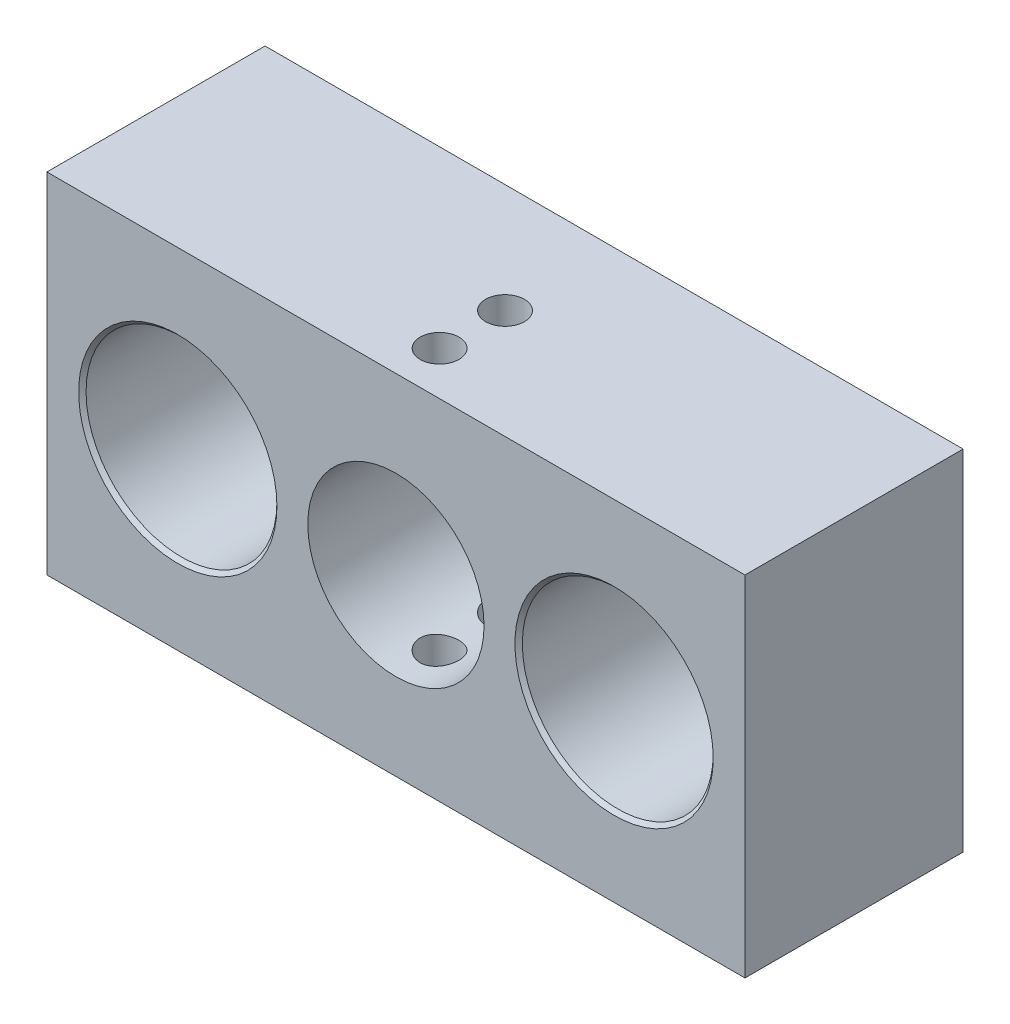
ISO-10303-21;
HEADER;
FILE_DESCRIPTION(('STEP AP214'),'2;1');
FILE_NAME('part.step','',(''),(''),'','','');
FILE_SCHEMA(('AUTOMOTIVE_DESIGN { 1 0 10303 214 1 1 1 1 }'));
ENDSEC;
DATA;
#1=APPLICATION_CONTEXT('core data for automotive mechanical design processes');
#2=APPLICATION_PROTOCOL_DEFINITION('international standard','automotive_design',2000,#1);
#3=PRODUCT_CONTEXT('',#1,'mechanical');
#4=PRODUCT('Part','Part','',(#3));
#5=PRODUCT_RELATED_PRODUCT_CATEGORY('part','',(#4));
#6=PRODUCT_DEFINITION_FORMATION('','',#4);
#7=PRODUCT_DEFINITION_CONTEXT('part definition',#1,'design');
#8=PRODUCT_DEFINITION('design','',#6,#7);
#9=PRODUCT_DEFINITION_SHAPE('','',#8);
#10=(LENGTH_UNIT() NAMED_UNIT(*) SI_UNIT(.MILLI.,.METRE.));
#11=(NAMED_UNIT(*) PLANE_ANGLE_UNIT() SI_UNIT($,.RADIAN.));
#12=(NAMED_UNIT(*) SI_UNIT($,.STERADIAN.) SOLID_ANGLE_UNIT());
#13=UNCERTAINTY_MEASURE_WITH_UNIT(LENGTH_MEASURE(1.E-05),#10,'distance_accuracy_value','');
#14=(GEOMETRIC_REPRESENTATION_CONTEXT(3) GLOBAL_UNCERTAINTY_ASSIGNED_CONTEXT((#13)) GLOBAL_UNIT_ASSIGNED_CONTEXT((#10,
#11,#12)) REPRESENTATION_CONTEXT('',''));
#15=CARTESIAN_POINT('',(0.,0.,0.));
#16=DIRECTION('',(0.,0.,1.));
#17=DIRECTION('',(1.,0.,0.));
#18=AXIS2_PLACEMENT_3D('',#15,#16,#17);
#19=CARTESIAN_POINT('',(0.,0.,12.7));
#20=DIRECTION('',(1.,0.,0.));
#21=DIRECTION('',(0.,1.,0.));
#22=AXIS2_PLACEMENT_3D('',#19,#20,#21);
#23=PLANE('',#22);
#24=DIRECTION('',(0.,-1.,0.));
#25=VECTOR('',#24,1.);
#26=CARTESIAN_POINT('',(0.,0.,0.));
#27=LINE('',#26,#25);
#28=CARTESIAN_POINT('',(0.,20.32,0.));
#29=VERTEX_POINT('',#28);
#30=CARTESIAN_POINT('',(0.,0.,0.));
#31=VERTEX_POINT('',#30);
#32=EDGE_CURVE('E105',#29,#31,#27,.T.);
#33=ORIENTED_EDGE('',*,*,#32,.T.);
#34=DIRECTION('',(0.,0.,-1.));
#35=VECTOR('',#34,1.);
#36=CARTESIAN_POINT('',(0.,0.,12.7));
#37=LINE('',#36,#35);
#38=CARTESIAN_POINT('',(0.,0.,12.7));
#39=VERTEX_POINT('',#38);
#40=EDGE_CURVE('E11',#39,#31,#37,.T.);
#41=ORIENTED_EDGE('',*,*,#40,.F.);
#42=DIRECTION('',(0.,-1.,0.));
#43=VECTOR('',#42,1.);
#44=CARTESIAN_POINT('',(0.,0.,12.7));
#45=LINE('',#44,#43);
#46=CARTESIAN_POINT('',(0.,20.32,12.7));
#47=VERTEX_POINT('',#46);
#48=EDGE_CURVE('E92',#47,#39,#45,.T.);
#49=ORIENTED_EDGE('',*,*,#48,.F.);
#50=DIRECTION('',(0.,0.,-1.));
#51=VECTOR('',#50,1.);
#52=CARTESIAN_POINT('',(0.,20.32,12.7));
#53=LINE('',#52,#51);
#54=EDGE_CURVE('E101',#47,#29,#53,.T.);
#55=ORIENTED_EDGE('',*,*,#54,.T.);
#56=EDGE_LOOP('',(#33,#41,#49,#55));
#57=FACE_BOUND('',#56,.T.);
#58=ADVANCED_FACE('F35',(#57),#23,.F.);
#59=CARTESIAN_POINT('',(0.,0.,12.7));
#60=DIRECTION('',(0.,1.,0.));
#61=DIRECTION('',(0.,0.,1.));
#62=AXIS2_PLACEMENT_3D('',#59,#60,#61);
#63=PLANE('',#62);
#64=CARTESIAN_POINT('',(20.32,0.,10.16));
#65=DIRECTION('',(0.,1.,0.));
#66=DIRECTION('',(0.,0.,1.));
#67=AXIS2_PLACEMENT_3D('',#64,#65,#66);
#68=CIRCLE('',#67,1.13029999999999);
#69=CARTESIAN_POINT('',(20.32,0.,11.2903));
#70=VERTEX_POINT('',#69);
#71=EDGE_CURVE('E143',#70,#70,#68,.T.);
#72=ORIENTED_EDGE('',*,*,#71,.T.);
#73=EDGE_LOOP('',(#72));
#74=FACE_BOUND('',#73,.T.);
#75=CARTESIAN_POINT('',(20.32,0.,6.35));
#76=DIRECTION('',(0.,1.,0.));
#77=DIRECTION('',(0.,0.,1.));
#78=AXIS2_PLACEMENT_3D('',#75,#76,#77);
#79=CIRCLE('',#78,1.13029999999999);
#80=CARTESIAN_POINT('',(20.32,0.,7.4803));
#81=VERTEX_POINT('',#80);
#82=EDGE_CURVE('E121',#81,#81,#79,.T.);
#83=ORIENTED_EDGE('',*,*,#82,.T.);
#84=EDGE_LOOP('',(#83));
#85=FACE_BOUND('',#84,.T.);
#86=DIRECTION('',(1.,0.,0.));
#87=VECTOR('',#86,1.);
#88=CARTESIAN_POINT('',(0.,0.,0.));
#89=LINE('',#88,#87);
#90=CARTESIAN_POINT('',(40.64,0.,0.));
#91=VERTEX_POINT('',#90);
#92=EDGE_CURVE('E96',#31,#91,#89,.T.);
#93=ORIENTED_EDGE('',*,*,#92,.T.);
#94=DIRECTION('',(0.,0.,-1.));
#95=VECTOR('',#94,1.);
#96=CARTESIAN_POINT('',(40.64,0.,12.7));
#97=LINE('',#96,#95);
#98=CARTESIAN_POINT('',(40.64,0.,12.7));
#99=VERTEX_POINT('',#98);
#100=EDGE_CURVE('E48',#99,#91,#97,.T.);
#101=ORIENTED_EDGE('',*,*,#100,.F.);
#102=DIRECTION('',(1.,0.,0.));
#103=VECTOR('',#102,1.);
#104=CARTESIAN_POINT('',(0.,0.,12.7));
#105=LINE('',#104,#103);
#106=EDGE_CURVE('E87',#39,#99,#105,.T.);
#107=ORIENTED_EDGE('',*,*,#106,.F.);
#108=ORIENTED_EDGE('',*,*,#40,.T.);
#109=EDGE_LOOP('',(#93,#101,#107,#108));
#110=FACE_BOUND('',#109,.T.);
#111=ADVANCED_FACE('F95',(#74,#85,#110),#63,.F.);
#112=CARTESIAN_POINT('',(40.64,0.,12.7));
#113=DIRECTION('',(-1.,0.,0.));
#114=DIRECTION('',(0.,0.,1.));
#115=AXIS2_PLACEMENT_3D('',#112,#113,#114);
#116=PLANE('',#115);
#117=DIRECTION('',(0.,1.,0.));
#118=VECTOR('',#117,1.);
#119=CARTESIAN_POINT('',(40.64,0.,0.));
#120=LINE('',#119,#118);
#121=CARTESIAN_POINT('',(40.64,20.32,0.));
#122=VERTEX_POINT('',#121);
#123=EDGE_CURVE('E74',#91,#122,#120,.T.);
#124=ORIENTED_EDGE('',*,*,#123,.T.);
#125=DIRECTION('',(0.,0.,-1.));
#126=VECTOR('',#125,1.);
#127=CARTESIAN_POINT('',(40.64,20.32,12.7));
#128=LINE('',#127,#126);
#129=CARTESIAN_POINT('',(40.64,20.32,12.7));
#130=VERTEX_POINT('',#129);
#131=EDGE_CURVE('E97',#130,#122,#128,.T.);
#132=ORIENTED_EDGE('',*,*,#131,.F.);
#133=DIRECTION('',(0.,1.,0.));
#134=VECTOR('',#133,1.);
#135=CARTESIAN_POINT('',(40.64,0.,12.7));
#136=LINE('',#135,#134);
#137=EDGE_CURVE('E90',#99,#130,#136,.T.);
#138=ORIENTED_EDGE('',*,*,#137,.F.);
#139=ORIENTED_EDGE('',*,*,#100,.T.);
#140=EDGE_LOOP('',(#124,#132,#138,#139));
#141=FACE_BOUND('',#140,.T.);
#142=ADVANCED_FACE('F99',(#141),#116,.F.);
#143=CARTESIAN_POINT('',(0.,20.32,12.7));
#144=DIRECTION('',(0.,-1.,0.));
#145=DIRECTION('',(0.,0.,-1.));
#146=AXIS2_PLACEMENT_3D('',#143,#144,#145);
#147=PLANE('',#146);
#148=CARTESIAN_POINT('',(20.32,20.32,10.16));
#149=DIRECTION('',(0.,1.,0.));
#150=DIRECTION('',(0.,0.,1.));
#151=AXIS2_PLACEMENT_3D('',#148,#149,#150);
#152=CIRCLE('',#151,1.1303);
#153=CARTESIAN_POINT('',(20.32,20.32,11.2903));
#154=VERTEX_POINT('',#153);
#155=EDGE_CURVE('E149',#154,#154,#152,.T.);
#156=ORIENTED_EDGE('',*,*,#155,.F.);
#157=EDGE_LOOP('',(#156));
#158=FACE_BOUND('',#157,.T.);
#159=CARTESIAN_POINT('',(20.32,20.32,6.35));
#160=DIRECTION('',(0.,1.,0.));
#161=DIRECTION('',(0.,0.,1.));
#162=AXIS2_PLACEMENT_3D('',#159,#160,#161);
#163=CIRCLE('',#162,1.1303);
#164=CARTESIAN_POINT('',(20.32,20.32,7.4803));
#165=VERTEX_POINT('',#164);
#166=EDGE_CURVE('E147',#165,#165,#163,.T.);
#167=ORIENTED_EDGE('',*,*,#166,.F.);
#168=EDGE_LOOP('',(#167));
#169=FACE_BOUND('',#168,.T.);
#170=DIRECTION('',(-1.,0.,0.));
#171=VECTOR('',#170,1.);
#172=CARTESIAN_POINT('',(0.,20.32,0.));
#173=LINE('',#172,#171);
#174=EDGE_CURVE('E80',#122,#29,#173,.T.);
#175=ORIENTED_EDGE('',*,*,#174,.T.);
#176=ORIENTED_EDGE('',*,*,#54,.F.);
#177=DIRECTION('',(-1.,0.,0.));
#178=VECTOR('',#177,1.);
#179=CARTESIAN_POINT('',(0.,20.32,12.7));
#180=LINE('',#179,#178);
#181=EDGE_CURVE('E57',#130,#47,#180,.T.);
#182=ORIENTED_EDGE('',*,*,#181,.F.);
#183=ORIENTED_EDGE('',*,*,#131,.T.);
#184=EDGE_LOOP('',(#175,#176,#182,#183));
#185=FACE_BOUND('',#184,.T.);
#186=ADVANCED_FACE('F225',(#158,#169,#185),#147,.F.);
#187=CARTESIAN_POINT('',(0.,0.,12.7));
#188=DIRECTION('',(0.,0.,-1.));
#189=DIRECTION('',(-1.,0.,0.));
#190=AXIS2_PLACEMENT_3D('',#187,#188,#189);
#191=PLANE('',#190);
#192=CARTESIAN_POINT('',(20.32,10.16,12.7));
#193=DIRECTION('',(0.,0.,1.));
#194=DIRECTION('',(1.,0.,0.));
#195=AXIS2_PLACEMENT_3D('',#192,#193,#194);
#196=CIRCLE('',#195,5.13080000000001);
#197=CARTESIAN_POINT('',(25.4508,10.16,12.7));
#198=VERTEX_POINT('',#197);
#199=EDGE_CURVE('E160',#198,#198,#196,.T.);
#200=ORIENTED_EDGE('',*,*,#199,.F.);
#201=EDGE_LOOP('',(#200));
#202=FACE_BOUND('',#201,.T.);
#203=CARTESIAN_POINT('',(7.62,10.16,12.7));
#204=DIRECTION('',(0.,0.,1.));
#205=DIRECTION('',(1.,0.,0.));
#206=AXIS2_PLACEMENT_3D('',#203,#204,#205);
#207=CIRCLE('',#206,5.77215);
#208=CARTESIAN_POINT('',(13.39215,10.16,12.7));
#209=VERTEX_POINT('',#208);
#210=EDGE_CURVE('E166',#209,#209,#207,.T.);
#211=ORIENTED_EDGE('',*,*,#210,.F.);
#212=EDGE_LOOP('',(#211));
#213=FACE_BOUND('',#212,.T.);
#214=CARTESIAN_POINT('',(33.02,10.16,12.7));
#215=DIRECTION('',(0.,0.,1.));
#216=DIRECTION('',(1.,0.,0.));
#217=AXIS2_PLACEMENT_3D('',#214,#215,#216);
#218=CIRCLE('',#217,5.77215);
#219=CARTESIAN_POINT('',(38.79215,10.16,12.7));
#220=VERTEX_POINT('',#219);
#221=EDGE_CURVE('E181',#220,#220,#218,.T.);
#222=ORIENTED_EDGE('',*,*,#221,.F.);
#223=EDGE_LOOP('',(#222));
#224=FACE_BOUND('',#223,.T.);
#225=ORIENTED_EDGE('',*,*,#48,.T.);
#226=ORIENTED_EDGE('',*,*,#106,.T.);
#227=ORIENTED_EDGE('',*,*,#137,.T.);
#228=ORIENTED_EDGE('',*,*,#181,.T.);
#229=EDGE_LOOP('',(#225,#226,#227,#228));
#230=FACE_BOUND('',#229,.T.);
#231=ADVANCED_FACE('F88',(#202,#213,#224,#230),#191,.F.);
#232=CARTESIAN_POINT('',(0.,0.,0.));
#233=DIRECTION('',(0.,0.,-1.));
#234=DIRECTION('',(-1.,0.,0.));
#235=AXIS2_PLACEMENT_3D('',#232,#233,#234);
#236=PLANE('',#235);
#237=CARTESIAN_POINT('',(7.62,10.16,0.));
#238=DIRECTION('',(0.,0.,1.));
#239=DIRECTION('',(1.,0.,0.));
#240=AXIS2_PLACEMENT_3D('',#237,#238,#239);
#241=CIRCLE('',#240,3.3782);
#242=CARTESIAN_POINT('',(10.9982,10.16,0.));
#243=VERTEX_POINT('',#242);
#244=EDGE_CURVE('E178',#243,#243,#241,.T.);
#245=ORIENTED_EDGE('',*,*,#244,.T.);
#246=EDGE_LOOP('',(#245));
#247=FACE_BOUND('',#246,.T.);
#248=CARTESIAN_POINT('',(33.02,10.16,0.));
#249=DIRECTION('',(0.,0.,1.));
#250=DIRECTION('',(1.,0.,0.));
#251=AXIS2_PLACEMENT_3D('',#248,#249,#250);
#252=CIRCLE('',#251,3.3782);
#253=CARTESIAN_POINT('',(36.3982,10.16,0.));
#254=VERTEX_POINT('',#253);
#255=EDGE_CURVE('E108',#254,#254,#252,.T.);
#256=ORIENTED_EDGE('',*,*,#255,.T.);
#257=EDGE_LOOP('',(#256));
#258=FACE_BOUND('',#257,.T.);
#259=ORIENTED_EDGE('',*,*,#32,.F.);
#260=ORIENTED_EDGE('',*,*,#174,.F.);
#261=ORIENTED_EDGE('',*,*,#123,.F.);
#262=ORIENTED_EDGE('',*,*,#92,.F.);
#263=EDGE_LOOP('',(#259,#260,#261,#262));
#264=FACE_BOUND('',#263,.T.);
#265=ADVANCED_FACE('F196',(#247,#258,#264),#236,.T.);
#266=CARTESIAN_POINT('',(33.02,10.16,12.7));
#267=DIRECTION('',(0.,0.,1.));
#268=DIRECTION('',(1.,0.,0.));
#269=AXIS2_PLACEMENT_3D('',#266,#267,#268);
#270=CYLINDRICAL_SURFACE('',#269,3.3782);
#271=ORIENTED_EDGE('',*,*,#255,.F.);
#272=EDGE_LOOP('',(#271));
#273=FACE_BOUND('',#272,.T.);
#274=CARTESIAN_POINT('',(33.02,10.16,3.175));
#275=DIRECTION('',(0.,0.,1.));
#276=DIRECTION('',(1.,0.,0.));
#277=AXIS2_PLACEMENT_3D('',#274,#275,#276);
#278=CIRCLE('',#277,3.3782);
#279=CARTESIAN_POINT('',(36.3982,10.16,3.175));
#280=VERTEX_POINT('',#279);
#281=EDGE_CURVE('E190',#280,#280,#278,.T.);
#282=ORIENTED_EDGE('',*,*,#281,.T.);
#283=EDGE_LOOP('',(#282));
#284=FACE_BOUND('',#283,.T.);
#285=ADVANCED_FACE('F199',(#273,#284),#270,.F.);
#286=CARTESIAN_POINT('',(38.57625,10.16,3.175));
#287=DIRECTION('',(0.,0.,-1.));
#288=DIRECTION('',(-1.,0.,0.));
#289=AXIS2_PLACEMENT_3D('',#286,#287,#288);
#290=PLANE('',#289);
#291=ORIENTED_EDGE('',*,*,#281,.F.);
#292=EDGE_LOOP('',(#291));
#293=FACE_BOUND('',#292,.T.);
#294=CARTESIAN_POINT('',(33.02,10.16,3.175));
#295=DIRECTION('',(0.,0.,1.));
#296=DIRECTION('',(1.,0.,0.));
#297=AXIS2_PLACEMENT_3D('',#294,#295,#296);
#298=CIRCLE('',#297,5.55625);
#299=CARTESIAN_POINT('',(38.57625,10.16,3.175));
#300=VERTEX_POINT('',#299);
#301=EDGE_CURVE('E187',#300,#300,#298,.T.);
#302=ORIENTED_EDGE('',*,*,#301,.T.);
#303=EDGE_LOOP('',(#302));
#304=FACE_BOUND('',#303,.T.);
#305=ADVANCED_FACE('F202',(#293,#304),#290,.F.);
#306=CARTESIAN_POINT('',(33.02,10.16,12.7));
#307=DIRECTION('',(0.,0.,1.));
#308=DIRECTION('',(1.,0.,0.));
#309=AXIS2_PLACEMENT_3D('',#306,#307,#308);
#310=CYLINDRICAL_SURFACE('',#309,5.55625);
#311=ORIENTED_EDGE('',*,*,#301,.F.);
#312=EDGE_LOOP('',(#311));
#313=FACE_BOUND('',#312,.T.);
#314=CARTESIAN_POINT('',(33.02,10.16,12.4841));
#315=DIRECTION('',(0.,0.,1.));
#316=DIRECTION('',(1.,0.,0.));
#317=AXIS2_PLACEMENT_3D('',#314,#315,#316);
#318=CIRCLE('',#317,5.55625);
#319=CARTESIAN_POINT('',(38.57625,10.16,12.4841));
#320=VERTEX_POINT('',#319);
#321=EDGE_CURVE('E184',#320,#320,#318,.T.);
#322=ORIENTED_EDGE('',*,*,#321,.T.);
#323=EDGE_LOOP('',(#322));
#324=FACE_BOUND('',#323,.T.);
#325=ADVANCED_FACE('F208',(#313,#324),#310,.F.);
#326=CARTESIAN_POINT('',(33.02,10.16,12.7));
#327=DIRECTION('',(0.,0.,1.));
#328=DIRECTION('',(1.,0.,0.));
#329=AXIS2_PLACEMENT_3D('',#326,#327,#328);
#330=CONICAL_SURFACE('',#329,5.77215,0.78539816339744);
#331=ORIENTED_EDGE('',*,*,#321,.F.);
#332=EDGE_LOOP('',(#331));
#333=FACE_BOUND('',#332,.T.);
#334=ORIENTED_EDGE('',*,*,#221,.T.);
#335=EDGE_LOOP('',(#334));
#336=FACE_BOUND('',#335,.T.);
#337=ADVANCED_FACE('F214',(#333,#336),#330,.F.);
#338=CARTESIAN_POINT('',(7.62,10.16,12.7));
#339=DIRECTION('',(0.,0.,1.));
#340=DIRECTION('',(1.,0.,0.));
#341=AXIS2_PLACEMENT_3D('',#338,#339,#340);
#342=CYLINDRICAL_SURFACE('',#341,3.3782);
#343=ORIENTED_EDGE('',*,*,#244,.F.);
#344=EDGE_LOOP('',(#343));
#345=FACE_BOUND('',#344,.T.);
#346=CARTESIAN_POINT('',(7.62,10.16,3.175));
#347=DIRECTION('',(0.,0.,1.));
#348=DIRECTION('',(1.,0.,0.));
#349=AXIS2_PLACEMENT_3D('',#346,#347,#348);
#350=CIRCLE('',#349,3.3782);
#351=CARTESIAN_POINT('',(10.9982,10.16,3.175));
#352=VERTEX_POINT('',#351);
#353=EDGE_CURVE('E175',#352,#352,#350,.T.);
#354=ORIENTED_EDGE('',*,*,#353,.T.);
#355=EDGE_LOOP('',(#354));
#356=FACE_BOUND('',#355,.T.);
#357=ADVANCED_FACE('F220',(#345,#356),#342,.F.);
#358=CARTESIAN_POINT('',(13.17625,10.16,3.175));
#359=DIRECTION('',(0.,0.,-1.));
#360=DIRECTION('',(-1.,0.,0.));
#361=AXIS2_PLACEMENT_3D('',#358,#359,#360);
#362=PLANE('',#361);
#363=ORIENTED_EDGE('',*,*,#353,.F.);
#364=EDGE_LOOP('',(#363));
#365=FACE_BOUND('',#364,.T.);
#366=CARTESIAN_POINT('',(7.62,10.16,3.175));
#367=DIRECTION('',(0.,0.,1.));
#368=DIRECTION('',(1.,0.,0.));
#369=AXIS2_PLACEMENT_3D('',#366,#367,#368);
#370=CIRCLE('',#369,5.55625);
#371=CARTESIAN_POINT('',(13.17625,10.16,3.175));
#372=VERTEX_POINT('',#371);
#373=EDGE_CURVE('E172',#372,#372,#370,.T.);
#374=ORIENTED_EDGE('',*,*,#373,.T.);
#375=EDGE_LOOP('',(#374));
#376=FACE_BOUND('',#375,.T.);
#377=ADVANCED_FACE('F274',(#365,#376),#362,.F.);
#378=CARTESIAN_POINT('',(7.62,10.16,12.7));
#379=DIRECTION('',(0.,0.,1.));
#380=DIRECTION('',(1.,0.,0.));
#381=AXIS2_PLACEMENT_3D('',#378,#379,#380);
#382=CYLINDRICAL_SURFACE('',#381,5.55625);
#383=ORIENTED_EDGE('',*,*,#373,.F.);
#384=EDGE_LOOP('',(#383));
#385=FACE_BOUND('',#384,.T.);
#386=CARTESIAN_POINT('',(7.62,10.16,12.4841));
#387=DIRECTION('',(0.,0.,1.));
#388=DIRECTION('',(1.,0.,0.));
#389=AXIS2_PLACEMENT_3D('',#386,#387,#388);
#390=CIRCLE('',#389,5.55625);
#391=CARTESIAN_POINT('',(13.17625,10.16,12.4841));
#392=VERTEX_POINT('',#391);
#393=EDGE_CURVE('E169',#392,#392,#390,.T.);
#394=ORIENTED_EDGE('',*,*,#393,.T.);
#395=EDGE_LOOP('',(#394));
#396=FACE_BOUND('',#395,.T.);
#397=ADVANCED_FACE('F268',(#385,#396),#382,.F.);
#398=CARTESIAN_POINT('',(7.62,10.16,12.7));
#399=DIRECTION('',(0.,0.,1.));
#400=DIRECTION('',(1.,0.,0.));
#401=AXIS2_PLACEMENT_3D('',#398,#399,#400);
#402=CONICAL_SURFACE('',#401,5.77215,0.785398163397448);
#403=ORIENTED_EDGE('',*,*,#393,.F.);
#404=EDGE_LOOP('',(#403));
#405=FACE_BOUND('',#404,.T.);
#406=ORIENTED_EDGE('',*,*,#210,.T.);
#407=EDGE_LOOP('',(#406));
#408=FACE_BOUND('',#407,.T.);
#409=ADVANCED_FACE('F264',(#405,#408),#402,.F.);
#410=CARTESIAN_POINT('',(20.32,10.16,3.175));
#411=DIRECTION('',(0.,0.,-1.));
#412=DIRECTION('',(-1.,0.,0.));
#413=AXIS2_PLACEMENT_3D('',#410,#411,#412);
#414=PLANE('',#413);
#415=CARTESIAN_POINT('',(20.32,10.16,3.175));
#416=DIRECTION('',(0.,0.,1.));
#417=DIRECTION('',(1.,0.,0.));
#418=AXIS2_PLACEMENT_3D('',#415,#416,#417);
#419=CIRCLE('',#418,5.13080000000001);
#420=CARTESIAN_POINT('',(25.4508,10.16,3.175));
#421=VERTEX_POINT('',#420);
#422=EDGE_CURVE('E163',#421,#421,#419,.T.);
#423=ORIENTED_EDGE('',*,*,#422,.T.);
#424=EDGE_LOOP('',(#423));
#425=FACE_BOUND('',#424,.T.);
#426=ADVANCED_FACE('F256',(#425),#414,.F.);
#427=CARTESIAN_POINT('',(20.32,10.16,12.7));
#428=DIRECTION('',(0.,0.,1.));
#429=DIRECTION('',(1.,0.,0.));
#430=AXIS2_PLACEMENT_3D('',#427,#428,#429);
#431=CYLINDRICAL_SURFACE('',#430,5.13080000000001);
#432=CARTESIAN_POINT('',(20.32,5.02919999999999,11.2903));
#433=CARTESIAN_POINT('',(20.2573219160591,5.0292011544134,11.2902978752993));
#434=CARTESIAN_POINT('',(20.1946182554503,5.0303601776866,11.2850689064002));
#435=CARTESIAN_POINT('',(20.0709927719037,5.03487178645669,11.2643133541529));
#436=CARTESIAN_POINT('',(20.0100722416246,5.03822592404732,11.2487794844392));
#437=CARTESIAN_POINT('',(19.8918174658165,5.0467544005245,11.2079248847462));
#438=CARTESIAN_POINT('',(19.8344795207196,5.05192682390269,11.1826144513156));
#439=CARTESIAN_POINT('',(19.724865942065,5.0635339738036,11.1229580432425));
#440=CARTESIAN_POINT('',(19.672590192185,5.06996867131072,11.0886122762869));
#441=CARTESIAN_POINT('',(19.573732802766,5.0835127708652,11.0112690634877));
#442=CARTESIAN_POINT('',(19.5272452773042,5.09063064098196,10.9681527970232));
#443=CARTESIAN_POINT('',(19.4421000930962,5.10467935531677,10.8747475505647));
#444=CARTESIAN_POINT('',(19.4034431405306,5.11161018261802,10.8244579243555));
#445=CARTESIAN_POINT('',(19.3346399047327,5.12458365566658,10.717435991638));
#446=CARTESIAN_POINT('',(19.3045940530291,5.13061545511933,10.6606376864405));
#447=CARTESIAN_POINT('',(19.2545102053322,5.14098629054407,10.5426432840008));
#448=CARTESIAN_POINT('',(19.234470994169,5.14532553204013,10.4814477217784));
#449=CARTESIAN_POINT('',(19.205280780433,5.15173366736412,10.3574175165217));
#450=CARTESIAN_POINT('',(19.1959630214741,5.15383729228967,10.2946239521598));
#451=CARTESIAN_POINT('',(19.1879616569993,5.15564030777462,10.1683323483302));
#452=CARTESIAN_POINT('',(19.1892767248565,5.15533999826596,10.1048343977338));
#453=CARTESIAN_POINT('',(19.2023695425516,5.15240050869015,9.98017797875042));
#454=CARTESIAN_POINT('',(19.2139533432465,5.14980468697107,9.91899796206095));
#455=CARTESIAN_POINT('',(19.2469474308058,5.14263523439493,9.79947155363101));
#456=CARTESIAN_POINT('',(19.2683582760958,5.13806149114257,9.74112532312992));
#457=CARTESIAN_POINT('',(19.3205761520776,5.12740895417049,9.62837868180645));
#458=CARTESIAN_POINT('',(19.3514575594936,5.12131832143159,9.57401388324181));
#459=CARTESIAN_POINT('',(19.4216876665217,5.10832549984097,9.47116628118922));
#460=CARTESIAN_POINT('',(19.4610375360674,5.10142319891561,9.42268429187093));
#461=CARTESIAN_POINT('',(19.5481131954782,5.08739888601198,9.33186214398028));
#462=CARTESIAN_POINT('',(19.5960038496458,5.08027537656772,9.2896801221565));
#463=CARTESIAN_POINT('',(19.6982603308901,5.06674916563056,9.21392028958861));
#464=CARTESIAN_POINT('',(19.752626278534,5.0603464775634,9.18034263909117));
#465=CARTESIAN_POINT('',(19.8664846528425,5.04896206362739,9.12270473741646));
#466=CARTESIAN_POINT('',(19.9259880209604,5.04398347302569,9.09866544137605));
#467=CARTESIAN_POINT('',(20.0483237597559,5.03603148026805,9.06097080334443));
#468=CARTESIAN_POINT('',(20.1111556377425,5.03305778223444,9.04731392910008));
#469=CARTESIAN_POINT('',(20.2370085903685,5.0294928234158,9.03100235281824));
#470=CARTESIAN_POINT('',(20.3000003844654,5.02885479961266,9.02813166694003));
#471=CARTESIAN_POINT('',(20.4255634798779,5.0299019333558,9.03288821247717));
#472=CARTESIAN_POINT('',(20.4881348098484,5.0315869309391,9.0405147210569));
#473=CARTESIAN_POINT('',(20.610363534366,5.0370612447256,9.0658701144836));
#474=CARTESIAN_POINT('',(20.6700456269484,5.04082690707367,9.08348549975974));
#475=CARTESIAN_POINT('',(20.785607808864,5.05004096777386,9.12819245823515));
#476=CARTESIAN_POINT('',(20.8414875705983,5.05548951089506,9.15528484671613));
#477=CARTESIAN_POINT('',(20.9487503776862,5.06758017082409,9.21862527231828));
#478=CARTESIAN_POINT('',(21.0000568053095,5.07423839241349,9.25499991371493));
#479=CARTESIAN_POINT('',(21.0959149362329,5.08797735855574,9.3357058232722));
#480=CARTESIAN_POINT('',(21.1404657473014,5.09505815874782,9.38003814073808));
#481=CARTESIAN_POINT('',(21.22240366135,5.10900608114204,9.47639269205905));
#482=CARTESIAN_POINT('',(21.2596411033624,5.11586672494157,9.52854330718928));
#483=CARTESIAN_POINT('',(21.3248301081039,5.12844638678479,9.63848485107425));
#484=CARTESIAN_POINT('',(21.3527820744665,5.13416545444774,9.69627553451756));
#485=CARTESIAN_POINT('',(21.3984166024768,5.14375932766124,9.81554586598282));
#486=CARTESIAN_POINT('',(21.4161571992222,5.14764453257467,9.87700243105533));
#487=CARTESIAN_POINT('',(21.4410347791615,5.15314919624246,10.0021210653018));
#488=CARTESIAN_POINT('',(21.4481734861427,5.15476902332764,10.0657827742131));
#489=CARTESIAN_POINT('',(21.4515704626756,5.15553608207552,10.1919949713662));
#490=CARTESIAN_POINT('',(21.4480661071725,5.15473725874692,10.2545388593839));
#491=CARTESIAN_POINT('',(21.4308077006114,5.15087915343435,10.3781213920473));
#492=CARTESIAN_POINT('',(21.4170537739577,5.14781989888639,10.4391600549535));
#493=CARTESIAN_POINT('',(21.3798020756864,5.13981211378289,10.5578076305887));
#494=CARTESIAN_POINT('',(21.3563393239267,5.13487037839671,10.6154280275515));
#495=CARTESIAN_POINT('',(21.3003659057,5.12365186829724,10.7259496582337));
#496=CARTESIAN_POINT('',(21.2678542809857,5.11737495220909,10.7788503913716));
#497=CARTESIAN_POINT('',(21.1939207242673,5.10403253145682,10.8796001282511));
#498=CARTESIAN_POINT('',(21.1523298288636,5.09695350104701,10.9273233732524));
#499=CARTESIAN_POINT('',(21.0617601467123,5.08289485773588,11.0151910670497));
#500=CARTESIAN_POINT('',(21.0127796529774,5.07591526821402,11.0553337599115));
#501=CARTESIAN_POINT('',(20.9080418338021,5.06273259771217,11.1274086756848));
#502=CARTESIAN_POINT('',(20.8522035811565,5.05654098406301,11.1592255134409));
#503=CARTESIAN_POINT('',(20.7358467255188,5.04574717820908,11.2129715982874));
#504=CARTESIAN_POINT('',(20.6753320707406,5.04114366276088,11.2349090817831));
#505=CARTESIAN_POINT('',(20.5656369145147,5.03485957709541,11.2643944138461));
#506=CARTESIAN_POINT('',(20.5170468581741,5.03275044740425,11.2740903611331));
#507=CARTESIAN_POINT('',(20.4189764907477,5.02992023464161,11.2870438465654));
#508=CARTESIAN_POINT('',(20.3694962202991,5.02919908837192,11.2903016778537));
#509=CARTESIAN_POINT('',(20.32,5.02919999999999,11.2903));
#510=B_SPLINE_CURVE_WITH_KNOTS('',3,(#432,#433,#434,#435,#436,#437,#438,#439,#440,#441,#442,
#443,#444,#445,#446,#447,#448,#449,#450,#451,#452,#453,#454,#455,#456,#457,#458,#459,#460,#461,
#462,#463,#464,#465,#466,#467,#468,#469,#470,#471,#472,#473,#474,#475,#476,#477,#478,#479,#480,
#481,#482,#483,#484,#485,#486,#487,#488,#489,#490,#491,#492,#493,#494,#495,#496,#497,#498,#499,
#500,#501,#502,#503,#504,#505,#506,#507,#508,#509),.UNSPECIFIED.,.T.,.F.,(4,2,2,2,2,2,2,2,2,2,2,
2,2,2,2,2,2,2,2,2,2,2,2,2,2,2,2,2,2,2,2,2,2,2,2,2,2,2,4),(0.,0.187853066104585,
0.375839100698793,0.563627688324262,0.751411959804079,0.941933640984928,1.1324724962416,
1.32515072845262,1.51780555682658,1.70742159968374,1.89701398506383,2.08310000355243,
2.26919659775926,2.45679383771819,2.64441701123887,2.83615771528223,3.0279019900194,
3.22006521234824,3.41220006943687,3.60046644101022,3.7887198492311,3.97487588261003,
4.16104793444407,4.34990932995401,4.53879564719082,4.73121671935614,4.92362942600723,
5.11493749679242,5.30621445892374,5.49325688753215,5.68029704594765,5.8666683490204,
6.05305939574366,6.24327060071083,6.43352581167807,6.62629264774834,6.81889847547651,
6.96725081092421,7.11559639137525),.UNSPECIFIED.);
#511=CARTESIAN_POINT('',(20.32,5.02919999999999,11.2903));
#512=VERTEX_POINT('',#511);
#513=EDGE_CURVE('E38',#512,#512,#510,.T.);
#514=ORIENTED_EDGE('',*,*,#513,.T.);
#515=EDGE_LOOP('',(#514));
#516=FACE_BOUND('',#515,.T.);
#517=CARTESIAN_POINT('',(20.32,15.2908,11.2903));
#518=CARTESIAN_POINT('',(20.3826780839409,15.2907988455866,11.2902978752993));
#519=CARTESIAN_POINT('',(20.4453817445497,15.2896398223134,11.2850689064002));
#520=CARTESIAN_POINT('',(20.5690072280963,15.2851282135433,11.2643133541529));
#521=CARTESIAN_POINT('',(20.6299277583754,15.2817740759527,11.2487794844392));
#522=CARTESIAN_POINT('',(20.7481825341835,15.2732455994755,11.2079248847462));
#523=CARTESIAN_POINT('',(20.8055204792804,15.2680731760973,11.1826144513156));
#524=CARTESIAN_POINT('',(20.915134057935,15.2564660261964,11.1229580432425));
#525=CARTESIAN_POINT('',(20.967409807815,15.2500313286893,11.0886122762869));
#526=CARTESIAN_POINT('',(21.066267197234,15.2364872291348,11.0112690634877));
#527=CARTESIAN_POINT('',(21.1127547226959,15.229369359018,10.9681527970232));
#528=CARTESIAN_POINT('',(21.1978999069038,15.2153206446832,10.8747475505647));
#529=CARTESIAN_POINT('',(21.2365568594695,15.208389817382,10.8244579243555));
#530=CARTESIAN_POINT('',(21.3053600952673,15.1954163443334,10.717435991638));
#531=CARTESIAN_POINT('',(21.335405946971,15.1893845448807,10.6606376864405));
#532=CARTESIAN_POINT('',(21.3854897946678,15.1790137094559,10.5426432840008));
#533=CARTESIAN_POINT('',(21.405529005831,15.1746744679599,10.4814477217784));
#534=CARTESIAN_POINT('',(21.4347192195671,15.1682663326359,10.3574175165217));
#535=CARTESIAN_POINT('',(21.4440369785259,15.1661627077103,10.2946239521598));
#536=CARTESIAN_POINT('',(21.4520383430007,15.1643596922254,10.1683323483302));
#537=CARTESIAN_POINT('',(21.4507232751435,15.164660001734,10.1048343977338));
#538=CARTESIAN_POINT('',(21.4376304574484,15.1675994913098,9.98017797875042));
#539=CARTESIAN_POINT('',(21.4260466567535,15.1701953130289,9.91899796206095));
#540=CARTESIAN_POINT('',(21.3930525691942,15.1773647656051,9.79947155363102));
#541=CARTESIAN_POINT('',(21.3716417239042,15.1819385088574,9.74112532312992));
#542=CARTESIAN_POINT('',(21.3194238479224,15.1925910458295,9.62837868180645));
#543=CARTESIAN_POINT('',(21.2885424405064,15.1986816785684,9.57401388324181));
#544=CARTESIAN_POINT('',(21.2183123334783,15.211674500159,9.47116628118922));
#545=CARTESIAN_POINT('',(21.1789624639326,15.2185768010844,9.42268429187093));
#546=CARTESIAN_POINT('',(21.0918868045218,15.232601113988,9.33186214398028));
#547=CARTESIAN_POINT('',(21.0439961503542,15.2397246234323,9.2896801221565));
#548=CARTESIAN_POINT('',(20.94173966911,15.2532508343694,9.21392028958861));
#549=CARTESIAN_POINT('',(20.887373721466,15.2596535224366,9.18034263909117));
#550=CARTESIAN_POINT('',(20.7735153471575,15.2710379363726,9.12270473741646));
#551=CARTESIAN_POINT('',(20.7140119790397,15.2760165269743,9.09866544137605));
#552=CARTESIAN_POINT('',(20.5916762402441,15.283968519732,9.06097080334443));
#553=CARTESIAN_POINT('',(20.5288443622575,15.2869422177656,9.04731392910008));
#554=CARTESIAN_POINT('',(20.4029914096315,15.2905071765842,9.03100235281824));
#555=CARTESIAN_POINT('',(20.3399996155346,15.2911452003873,9.02813166694003));
#556=CARTESIAN_POINT('',(20.2144365201221,15.2900980666442,9.03288821247717));
#557=CARTESIAN_POINT('',(20.1518651901516,15.2884130690609,9.0405147210569));
#558=CARTESIAN_POINT('',(20.029636465634,15.2829387552744,9.0658701144836));
#559=CARTESIAN_POINT('',(19.9699543730516,15.2791730929263,9.08348549975974));
#560=CARTESIAN_POINT('',(19.854392191136,15.2699590322261,9.12819245823515));
#561=CARTESIAN_POINT('',(19.7985124294017,15.2645104891049,9.15528484671613));
#562=CARTESIAN_POINT('',(19.6912496223138,15.2524198291759,9.21862527231828));
#563=CARTESIAN_POINT('',(19.6399431946905,15.2457616075865,9.25499991371493));
#564=CARTESIAN_POINT('',(19.5440850637671,15.2320226414443,9.3357058232722));
#565=CARTESIAN_POINT('',(19.4995342526986,15.2249418412522,9.38003814073808));
#566=CARTESIAN_POINT('',(19.41759633865,15.210993918858,9.47639269205905));
#567=CARTESIAN_POINT('',(19.3803588966376,15.2041332750584,9.52854330718928));
#568=CARTESIAN_POINT('',(19.3151698918961,15.1915536132152,9.63848485107425));
#569=CARTESIAN_POINT('',(19.2872179255335,15.1858345455523,9.69627553451756));
#570=CARTESIAN_POINT('',(19.2415833975232,15.1762406723388,9.81554586598282));
#571=CARTESIAN_POINT('',(19.2238428007778,15.1723554674253,9.87700243105533));
#572=CARTESIAN_POINT('',(19.1989652208385,15.1668508037575,10.0021210653018));
#573=CARTESIAN_POINT('',(19.1918265138574,15.1652309766724,10.0657827742131));
#574=CARTESIAN_POINT('',(19.1884295373244,15.1644639179245,10.1919949713662));
#575=CARTESIAN_POINT('',(19.1919338928275,15.1652627412531,10.2545388593839));
#576=CARTESIAN_POINT('',(19.2091922993886,15.1691208465657,10.3781213920473));
#577=CARTESIAN_POINT('',(19.2229462260423,15.1721801011136,10.4391600549535));
#578=CARTESIAN_POINT('',(19.2601979243136,15.1801878862171,10.5578076305887));
#579=CARTESIAN_POINT('',(19.2836606760733,15.1851296216033,10.6154280275515));
#580=CARTESIAN_POINT('',(19.3396340943001,15.1963481317028,10.7259496582337));
#581=CARTESIAN_POINT('',(19.3721457190143,15.2026250477909,10.7788503913716));
#582=CARTESIAN_POINT('',(19.4460792757327,15.2159674685432,10.8796001282511));
#583=CARTESIAN_POINT('',(19.4876701711364,15.223046498953,10.9273233732524));
#584=CARTESIAN_POINT('',(19.5782398532877,15.2371051422641,11.0151910670497));
#585=CARTESIAN_POINT('',(19.6272203470226,15.244084731786,11.0553337599115));
#586=CARTESIAN_POINT('',(19.7319581661979,15.2572674022878,11.1274086756848));
#587=CARTESIAN_POINT('',(19.7877964188435,15.263459015937,11.1592255134409));
#588=CARTESIAN_POINT('',(19.9041532744812,15.2742528217909,11.2129715982874));
#589=CARTESIAN_POINT('',(19.9646679292594,15.2788563372391,11.2349090817831));
#590=CARTESIAN_POINT('',(20.0743630854854,15.2851404229046,11.2643944138461));
#591=CARTESIAN_POINT('',(20.1229531418259,15.2872495525957,11.2740903611331));
#592=CARTESIAN_POINT('',(20.2210235092523,15.2900797653584,11.2870438465654));
#593=CARTESIAN_POINT('',(20.2705037797009,15.2908009116281,11.2903016778537));
#594=CARTESIAN_POINT('',(20.32,15.2908,11.2903));
#595=B_SPLINE_CURVE_WITH_KNOTS('',3,(#517,#518,#519,#520,#521,#522,#523,#524,#525,#526,#527,
#528,#529,#530,#531,#532,#533,#534,#535,#536,#537,#538,#539,#540,#541,#542,#543,#544,#545,#546,
#547,#548,#549,#550,#551,#552,#553,#554,#555,#556,#557,#558,#559,#560,#561,#562,#563,#564,#565,
#566,#567,#568,#569,#570,#571,#572,#573,#574,#575,#576,#577,#578,#579,#580,#581,#582,#583,#584,
#585,#586,#587,#588,#589,#590,#591,#592,#593,#594),.UNSPECIFIED.,.T.,.F.,(4,2,2,2,2,2,2,2,2,2,2,
2,2,2,2,2,2,2,2,2,2,2,2,2,2,2,2,2,2,2,2,2,2,2,2,2,2,2,4),(0.,0.187853066104585,
0.375839100698793,0.563627688324259,0.751411959804079,0.941933640984932,1.1324724962416,
1.32515072845262,1.51780555682658,1.70742159968374,1.89701398506383,2.08310000355242,
2.26919659775926,2.45679383771819,2.64441701123887,2.83615771528223,3.0279019900194,
3.22006521234824,3.41220006943687,3.60046644101022,3.7887198492311,3.97487588261003,
4.16104793444407,4.34990932995401,4.53879564719082,4.73121671935614,4.92362942600723,
5.11493749679242,5.30621445892374,5.49325688753214,5.68029704594765,5.8666683490204,
6.05305939574366,6.24327060071082,6.43352581167807,6.62629264774834,6.81889847547651,
6.96725081092421,7.11559639137525),.UNSPECIFIED.);
#596=CARTESIAN_POINT('',(20.32,15.2908,11.2903));
#597=VERTEX_POINT('',#596);
#598=EDGE_CURVE('E139',#597,#597,#595,.T.);
#599=ORIENTED_EDGE('',*,*,#598,.T.);
#600=EDGE_LOOP('',(#599));
#601=FACE_BOUND('',#600,.T.);
#602=CARTESIAN_POINT('',(20.32,5.02919999999999,7.4803));
#603=CARTESIAN_POINT('',(20.2573219160591,5.0292011544134,7.48029787529927));
#604=CARTESIAN_POINT('',(20.1946182554503,5.0303601776866,7.47506890640016));
#605=CARTESIAN_POINT('',(20.0709927719037,5.03487178645669,7.45431335415286));
#606=CARTESIAN_POINT('',(20.0100722416246,5.03822592404732,7.43877948443922));
#607=CARTESIAN_POINT('',(19.8918174658165,5.0467544005245,7.39792488474622));
#608=CARTESIAN_POINT('',(19.8344795207196,5.05192682390269,7.37261445131562));
#609=CARTESIAN_POINT('',(19.724865942065,5.0635339738036,7.31295804324252));
#610=CARTESIAN_POINT('',(19.672590192185,5.06996867131072,7.27861227628689));
#611=CARTESIAN_POINT('',(19.573732802766,5.0835127708652,7.20126906348772));
#612=CARTESIAN_POINT('',(19.5272452773042,5.09063064098196,7.15815279702324));
#613=CARTESIAN_POINT('',(19.4421000930962,5.10467935531677,7.06474755056466));
#614=CARTESIAN_POINT('',(19.4034431405306,5.11161018261802,7.01445792435551));
#615=CARTESIAN_POINT('',(19.3346399047327,5.12458365566658,6.907435991638));
#616=CARTESIAN_POINT('',(19.3045940530291,5.13061545511933,6.85063768644054));
#617=CARTESIAN_POINT('',(19.2545102053322,5.14098629054407,6.73264328400082));
#618=CARTESIAN_POINT('',(19.234470994169,5.14532553204013,6.67144772177838));
#619=CARTESIAN_POINT('',(19.205280780433,5.15173366736412,6.54741751652172));
#620=CARTESIAN_POINT('',(19.1959630214741,5.15383729228967,6.48462395215983));
#621=CARTESIAN_POINT('',(19.1879616569993,5.15564030777462,6.35833234833016));
#622=CARTESIAN_POINT('',(19.1892767248565,5.15533999826596,6.2948343977338));
#623=CARTESIAN_POINT('',(19.2023695425516,5.15240050869015,6.17017797875042));
#624=CARTESIAN_POINT('',(19.2139533432465,5.14980468697107,6.10899796206095));
#625=CARTESIAN_POINT('',(19.2469474308058,5.14263523439493,5.98947155363102));
#626=CARTESIAN_POINT('',(19.2683582760958,5.13806149114257,5.93112532312992));
#627=CARTESIAN_POINT('',(19.3205761520776,5.12740895417049,5.81837868180645));
#628=CARTESIAN_POINT('',(19.3514575594936,5.12131832143159,5.76401388324182));
#629=CARTESIAN_POINT('',(19.4216876665217,5.10832549984097,5.66116628118922));
#630=CARTESIAN_POINT('',(19.4610375360674,5.10142319891561,5.61268429187093));
#631=CARTESIAN_POINT('',(19.5481131954782,5.08739888601198,5.52186214398028));
#632=CARTESIAN_POINT('',(19.5960038496458,5.08027537656772,5.4796801221565));
#633=CARTESIAN_POINT('',(19.6982603308901,5.06674916563056,5.40392028958861));
#634=CARTESIAN_POINT('',(19.752626278534,5.0603464775634,5.37034263909117));
#635=CARTESIAN_POINT('',(19.8664846528425,5.04896206362739,5.31270473741646));
#636=CARTESIAN_POINT('',(19.9259880209604,5.04398347302569,5.28866544137605));
#637=CARTESIAN_POINT('',(20.0483237597559,5.03603148026805,5.25097080334443));
#638=CARTESIAN_POINT('',(20.1111556377425,5.03305778223444,5.23731392910008));
#639=CARTESIAN_POINT('',(20.2370085903685,5.0294928234158,5.22100235281825));
#640=CARTESIAN_POINT('',(20.3000003844654,5.02885479961266,5.21813166694003));
#641=CARTESIAN_POINT('',(20.4255634798779,5.0299019333558,5.22288821247717));
#642=CARTESIAN_POINT('',(20.4881348098484,5.0315869309391,5.2305147210569));
#643=CARTESIAN_POINT('',(20.610363534366,5.0370612447256,5.2558701144836));
#644=CARTESIAN_POINT('',(20.6700456269484,5.04082690707367,5.27348549975974));
#645=CARTESIAN_POINT('',(20.785607808864,5.05004096777386,5.31819245823515));
#646=CARTESIAN_POINT('',(20.8414875705983,5.05548951089506,5.34528484671613));
#647=CARTESIAN_POINT('',(20.9487503776862,5.06758017082409,5.40862527231828));
#648=CARTESIAN_POINT('',(21.0000568053095,5.07423839241349,5.44499991371493));
#649=CARTESIAN_POINT('',(21.0959149362329,5.08797735855574,5.5257058232722));
#650=CARTESIAN_POINT('',(21.1404657473014,5.09505815874782,5.57003814073808));
#651=CARTESIAN_POINT('',(21.22240366135,5.10900608114204,5.66639269205905));
#652=CARTESIAN_POINT('',(21.2596411033624,5.11586672494157,5.71854330718928));
#653=CARTESIAN_POINT('',(21.3248301081039,5.12844638678479,5.82848485107426));
#654=CARTESIAN_POINT('',(21.3527820744665,5.13416545444774,5.88627553451756));
#655=CARTESIAN_POINT('',(21.3984166024768,5.14375932766124,6.00554586598282));
#656=CARTESIAN_POINT('',(21.4161571992222,5.14764453257467,6.06700243105534));
#657=CARTESIAN_POINT('',(21.4410347791615,5.15314919624246,6.19212106530178));
#658=CARTESIAN_POINT('',(21.4481734861427,5.15476902332764,6.25578277421309));
#659=CARTESIAN_POINT('',(21.4515704626756,5.15553608207552,6.38199497136623));
#660=CARTESIAN_POINT('',(21.4480661071725,5.15473725874692,6.44453885938388));
#661=CARTESIAN_POINT('',(21.4308077006114,5.15087915343435,6.5681213920473));
#662=CARTESIAN_POINT('',(21.4170537739577,5.14781989888639,6.62916005495346));
#663=CARTESIAN_POINT('',(21.3798020756864,5.13981211378289,6.74780763058872));
#664=CARTESIAN_POINT('',(21.3563393239267,5.13487037839671,6.80542802755147));
#665=CARTESIAN_POINT('',(21.3003659057,5.12365186829724,6.91594965823367));
#666=CARTESIAN_POINT('',(21.2678542809857,5.11737495220909,6.96885039137161));
#667=CARTESIAN_POINT('',(21.1939207242673,5.10403253145682,7.0696001282511));
#668=CARTESIAN_POINT('',(21.1523298288636,5.09695350104701,7.1173233732524));
#669=CARTESIAN_POINT('',(21.0617601467123,5.08289485773588,7.20519106704974));
#670=CARTESIAN_POINT('',(21.0127796529774,5.07591526821402,7.24533375991151));
#671=CARTESIAN_POINT('',(20.9080418338021,5.06273259771217,7.3174086756848));
#672=CARTESIAN_POINT('',(20.8522035811565,5.05654098406301,7.34922551344093));
#673=CARTESIAN_POINT('',(20.7358467255188,5.04574717820908,7.40297159828744));
#674=CARTESIAN_POINT('',(20.6753320707406,5.04114366276088,7.42490908178309));
#675=CARTESIAN_POINT('',(20.5656369145147,5.03485957709541,7.45439441384613));
#676=CARTESIAN_POINT('',(20.5170468581741,5.03275044740425,7.4640903611331));
#677=CARTESIAN_POINT('',(20.4189764907477,5.02992023464161,7.47704384656538));
#678=CARTESIAN_POINT('',(20.3694962202991,5.02919908837192,7.4803016778537));
#679=CARTESIAN_POINT('',(20.32,5.02919999999999,7.4803));
#680=B_SPLINE_CURVE_WITH_KNOTS('',3,(#602,#603,#604,#605,#606,#607,#608,#609,#610,#611,#612,
#613,#614,#615,#616,#617,#618,#619,#620,#621,#622,#623,#624,#625,#626,#627,#628,#629,#630,#631,
#632,#633,#634,#635,#636,#637,#638,#639,#640,#641,#642,#643,#644,#645,#646,#647,#648,#649,#650,
#651,#652,#653,#654,#655,#656,#657,#658,#659,#660,#661,#662,#663,#664,#665,#666,#667,#668,#669,
#670,#671,#672,#673,#674,#675,#676,#677,#678,#679),.UNSPECIFIED.,.T.,.F.,(4,2,2,2,2,2,2,2,2,2,2,
2,2,2,2,2,2,2,2,2,2,2,2,2,2,2,2,2,2,2,2,2,2,2,2,2,2,2,4),(0.,0.187853066104585,
0.375839100698793,0.563627688324262,0.751411959804079,0.941933640984929,1.1324724962416,
1.32515072845262,1.51780555682658,1.70742159968374,1.89701398506383,2.08310000355242,
2.26919659775926,2.45679383771819,2.64441701123887,2.83615771528223,3.0279019900194,
3.22006521234824,3.41220006943687,3.60046644101022,3.7887198492311,3.97487588261002,
4.16104793444407,4.34990932995401,4.53879564719082,4.73121671935614,4.92362942600723,
5.11493749679241,5.30621445892374,5.49325688753214,5.68029704594764,5.8666683490204,
6.05305939574366,6.24327060071083,6.43352581167807,6.62629264774833,6.81889847547651,
6.96725081092421,7.11559639137525),.UNSPECIFIED.);
#681=CARTESIAN_POINT('',(20.32,5.02919999999999,7.4803));
#682=VERTEX_POINT('',#681);
#683=EDGE_CURVE('E120',#682,#682,#680,.T.);
#684=ORIENTED_EDGE('',*,*,#683,.T.);
#685=EDGE_LOOP('',(#684));
#686=FACE_BOUND('',#685,.T.);
#687=CARTESIAN_POINT('',(20.32,15.2908,7.4803));
#688=CARTESIAN_POINT('',(20.3826780839409,15.2907988455866,7.48029787529927));
#689=CARTESIAN_POINT('',(20.4453817445497,15.2896398223134,7.47506890640016));
#690=CARTESIAN_POINT('',(20.5690072280963,15.2851282135433,7.45431335415286));
#691=CARTESIAN_POINT('',(20.6299277583754,15.2817740759527,7.43877948443922));
#692=CARTESIAN_POINT('',(20.7481825341835,15.2732455994755,7.39792488474622));
#693=CARTESIAN_POINT('',(20.8055204792804,15.2680731760973,7.37261445131562));
#694=CARTESIAN_POINT('',(20.915134057935,15.2564660261964,7.31295804324252));
#695=CARTESIAN_POINT('',(20.967409807815,15.2500313286893,7.27861227628689));
#696=CARTESIAN_POINT('',(21.066267197234,15.2364872291348,7.20126906348772));
#697=CARTESIAN_POINT('',(21.1127547226959,15.229369359018,7.15815279702324));
#698=CARTESIAN_POINT('',(21.1978999069038,15.2153206446832,7.06474755056466));
#699=CARTESIAN_POINT('',(21.2365568594695,15.208389817382,7.01445792435551));
#700=CARTESIAN_POINT('',(21.3053600952673,15.1954163443334,6.907435991638));
#701=CARTESIAN_POINT('',(21.335405946971,15.1893845448807,6.85063768644054));
#702=CARTESIAN_POINT('',(21.3854897946678,15.1790137094559,6.73264328400082));
#703=CARTESIAN_POINT('',(21.405529005831,15.1746744679599,6.67144772177838));
#704=CARTESIAN_POINT('',(21.4347192195671,15.1682663326359,6.54741751652172));
#705=CARTESIAN_POINT('',(21.4440369785259,15.1661627077103,6.48462395215983));
#706=CARTESIAN_POINT('',(21.4520383430007,15.1643596922254,6.35833234833016));
#707=CARTESIAN_POINT('',(21.4507232751435,15.164660001734,6.2948343977338));
#708=CARTESIAN_POINT('',(21.4376304574484,15.1675994913098,6.17017797875042));
#709=CARTESIAN_POINT('',(21.4260466567535,15.1701953130289,6.10899796206095));
#710=CARTESIAN_POINT('',(21.3930525691942,15.1773647656051,5.98947155363102));
#711=CARTESIAN_POINT('',(21.3716417239042,15.1819385088574,5.93112532312992));
#712=CARTESIAN_POINT('',(21.3194238479224,15.1925910458295,5.81837868180645));
#713=CARTESIAN_POINT('',(21.2885424405064,15.1986816785684,5.76401388324182));
#714=CARTESIAN_POINT('',(21.2183123334783,15.211674500159,5.66116628118922));
#715=CARTESIAN_POINT('',(21.1789624639326,15.2185768010844,5.61268429187093));
#716=CARTESIAN_POINT('',(21.0918868045218,15.232601113988,5.52186214398028));
#717=CARTESIAN_POINT('',(21.0439961503542,15.2397246234323,5.4796801221565));
#718=CARTESIAN_POINT('',(20.9417396691099,15.2532508343694,5.40392028958861));
#719=CARTESIAN_POINT('',(20.887373721466,15.2596535224366,5.37034263909117));
#720=CARTESIAN_POINT('',(20.7735153471575,15.2710379363726,5.31270473741646));
#721=CARTESIAN_POINT('',(20.7140119790397,15.2760165269743,5.28866544137605));
#722=CARTESIAN_POINT('',(20.5916762402441,15.283968519732,5.25097080334443));
#723=CARTESIAN_POINT('',(20.5288443622575,15.2869422177656,5.23731392910008));
#724=CARTESIAN_POINT('',(20.4029914096315,15.2905071765842,5.22100235281825));
#725=CARTESIAN_POINT('',(20.3399996155346,15.2911452003873,5.21813166694003));
#726=CARTESIAN_POINT('',(20.2144365201221,15.2900980666442,5.22288821247717));
#727=CARTESIAN_POINT('',(20.1518651901516,15.2884130690609,5.2305147210569));
#728=CARTESIAN_POINT('',(20.029636465634,15.2829387552744,5.2558701144836));
#729=CARTESIAN_POINT('',(19.9699543730516,15.2791730929263,5.27348549975974));
#730=CARTESIAN_POINT('',(19.854392191136,15.2699590322261,5.31819245823515));
#731=CARTESIAN_POINT('',(19.7985124294017,15.2645104891049,5.34528484671613));
#732=CARTESIAN_POINT('',(19.6912496223138,15.2524198291759,5.40862527231828));
#733=CARTESIAN_POINT('',(19.6399431946905,15.2457616075865,5.44499991371493));
#734=CARTESIAN_POINT('',(19.5440850637671,15.2320226414443,5.5257058232722));
#735=CARTESIAN_POINT('',(19.4995342526986,15.2249418412522,5.57003814073808));
#736=CARTESIAN_POINT('',(19.41759633865,15.210993918858,5.66639269205905));
#737=CARTESIAN_POINT('',(19.3803588966376,15.2041332750584,5.71854330718928));
#738=CARTESIAN_POINT('',(19.3151698918961,15.1915536132152,5.82848485107426));
#739=CARTESIAN_POINT('',(19.2872179255335,15.1858345455523,5.88627553451756));
#740=CARTESIAN_POINT('',(19.2415833975232,15.1762406723388,6.00554586598282));
#741=CARTESIAN_POINT('',(19.2238428007778,15.1723554674253,6.06700243105534));
#742=CARTESIAN_POINT('',(19.1989652208385,15.1668508037575,6.19212106530178));
#743=CARTESIAN_POINT('',(19.1918265138574,15.1652309766724,6.25578277421309));
#744=CARTESIAN_POINT('',(19.1884295373244,15.1644639179245,6.38199497136623));
#745=CARTESIAN_POINT('',(19.1919338928275,15.1652627412531,6.44453885938388));
#746=CARTESIAN_POINT('',(19.2091922993886,15.1691208465657,6.5681213920473));
#747=CARTESIAN_POINT('',(19.2229462260423,15.1721801011136,6.62916005495346));
#748=CARTESIAN_POINT('',(19.2601979243136,15.1801878862171,6.74780763058872));
#749=CARTESIAN_POINT('',(19.2836606760733,15.1851296216033,6.80542802755147));
#750=CARTESIAN_POINT('',(19.3396340943001,15.1963481317028,6.91594965823367));
#751=CARTESIAN_POINT('',(19.3721457190143,15.2026250477909,6.96885039137161));
#752=CARTESIAN_POINT('',(19.4460792757327,15.2159674685432,7.06960012825109));
#753=CARTESIAN_POINT('',(19.4876701711364,15.223046498953,7.1173233732524));
#754=CARTESIAN_POINT('',(19.5782398532877,15.2371051422641,7.20519106704974));
#755=CARTESIAN_POINT('',(19.6272203470226,15.244084731786,7.24533375991151));
#756=CARTESIAN_POINT('',(19.7319581661979,15.2572674022878,7.3174086756848));
#757=CARTESIAN_POINT('',(19.7877964188435,15.263459015937,7.34922551344093));
#758=CARTESIAN_POINT('',(19.9041532744812,15.2742528217909,7.40297159828744));
#759=CARTESIAN_POINT('',(19.9646679292594,15.2788563372391,7.42490908178309));
#760=CARTESIAN_POINT('',(20.0743630854854,15.2851404229046,7.45439441384613));
#761=CARTESIAN_POINT('',(20.1229531418259,15.2872495525957,7.4640903611331));
#762=CARTESIAN_POINT('',(20.2210235092523,15.2900797653584,7.47704384656538));
#763=CARTESIAN_POINT('',(20.2705037797009,15.2908009116281,7.4803016778537));
#764=CARTESIAN_POINT('',(20.32,15.2908,7.4803));
#765=B_SPLINE_CURVE_WITH_KNOTS('',3,(#687,#688,#689,#690,#691,#692,#693,#694,#695,#696,#697,
#698,#699,#700,#701,#702,#703,#704,#705,#706,#707,#708,#709,#710,#711,#712,#713,#714,#715,#716,
#717,#718,#719,#720,#721,#722,#723,#724,#725,#726,#727,#728,#729,#730,#731,#732,#733,#734,#735,
#736,#737,#738,#739,#740,#741,#742,#743,#744,#745,#746,#747,#748,#749,#750,#751,#752,#753,#754,
#755,#756,#757,#758,#759,#760,#761,#762,#763,#764),.UNSPECIFIED.,.T.,.F.,(4,2,2,2,2,2,2,2,2,2,2,
2,2,2,2,2,2,2,2,2,2,2,2,2,2,2,2,2,2,2,2,2,2,2,2,2,2,2,4),(0.,0.187853066104585,
0.375839100698793,0.563627688324258,0.751411959804079,0.941933640984932,1.1324724962416,
1.32515072845262,1.51780555682658,1.70742159968374,1.89701398506383,2.08310000355242,
2.26919659775926,2.45679383771819,2.64441701123887,2.83615771528224,3.0279019900194,
3.22006521234824,3.41220006943687,3.60046644101022,3.7887198492311,3.97487588261003,
4.16104793444407,4.34990932995401,4.53879564719082,4.73121671935614,4.92362942600723,
5.11493749679242,5.30621445892374,5.49325688753215,5.68029704594765,5.8666683490204,
6.05305939574366,6.24327060071082,6.43352581167807,6.62629264774833,6.81889847547651,
6.96725081092421,7.11559639137525),.UNSPECIFIED.);
#766=CARTESIAN_POINT('',(20.32,15.2908,7.4803));
#767=VERTEX_POINT('',#766);
#768=EDGE_CURVE('E114',#767,#767,#765,.T.);
#769=ORIENTED_EDGE('',*,*,#768,.T.);
#770=EDGE_LOOP('',(#769));
#771=FACE_BOUND('',#770,.T.);
#772=ORIENTED_EDGE('',*,*,#422,.F.);
#773=EDGE_LOOP('',(#772));
#774=FACE_BOUND('',#773,.T.);
#775=ORIENTED_EDGE('',*,*,#199,.T.);
#776=EDGE_LOOP('',(#775));
#777=FACE_BOUND('',#776,.T.);
#778=ADVANCED_FACE('F124',(#516,#601,#686,#771,#774,#777),#431,.F.);
#779=CARTESIAN_POINT('',(20.32,20.32,6.35));
#780=DIRECTION('',(0.,1.,0.));
#781=DIRECTION('',(0.,0.,1.));
#782=AXIS2_PLACEMENT_3D('',#779,#780,#781);
#783=CYLINDRICAL_SURFACE('',#782,1.1303);
#784=ORIENTED_EDGE('',*,*,#166,.T.);
#785=EDGE_LOOP('',(#784));
#786=FACE_BOUND('',#785,.T.);
#787=ORIENTED_EDGE('',*,*,#768,.F.);
#788=EDGE_LOOP('',(#787));
#789=FACE_BOUND('',#788,.T.);
#790=ADVANCED_FACE('F131',(#786,#789),#783,.F.);
#791=ORIENTED_EDGE('',*,*,#82,.F.);
#792=EDGE_LOOP('',(#791));
#793=FACE_BOUND('',#792,.T.);
#794=ORIENTED_EDGE('',*,*,#683,.F.);
#795=EDGE_LOOP('',(#794));
#796=FACE_BOUND('',#795,.T.);
#797=ADVANCED_FACE('F127',(#793,#796),#783,.F.);
#798=CARTESIAN_POINT('',(20.32,20.32,10.16));
#799=DIRECTION('',(0.,1.,0.));
#800=DIRECTION('',(0.,0.,1.));
#801=AXIS2_PLACEMENT_3D('',#798,#799,#800);
#802=CYLINDRICAL_SURFACE('',#801,1.1303);
#803=ORIENTED_EDGE('',*,*,#155,.T.);
#804=EDGE_LOOP('',(#803));
#805=FACE_BOUND('',#804,.T.);
#806=ORIENTED_EDGE('',*,*,#598,.F.);
#807=EDGE_LOOP('',(#806));
#808=FACE_BOUND('',#807,.T.);
#809=ADVANCED_FACE('F130',(#805,#808),#802,.F.);
#810=ORIENTED_EDGE('',*,*,#71,.F.);
#811=EDGE_LOOP('',(#810));
#812=FACE_BOUND('',#811,.T.);
#813=ORIENTED_EDGE('',*,*,#513,.F.);
#814=EDGE_LOOP('',(#813));
#815=FACE_BOUND('',#814,.T.);
#816=ADVANCED_FACE('F133',(#812,#815),#802,.F.);
#817=CLOSED_SHELL('',(#58,#111,#142,#186,#231,#265,#285,#305,#325,#337,#357,#377,#397,#409,#426,
#778,#790,#797,#809,#816));
#818=MANIFOLD_SOLID_BREP('B2',#817);
#819=ADVANCED_BREP_SHAPE_REPRESENTATION('',(#18,#818),#14);
#820=SHAPE_DEFINITION_REPRESENTATION(#9,#819);
ENDSEC;
END-ISO-10303-21;
